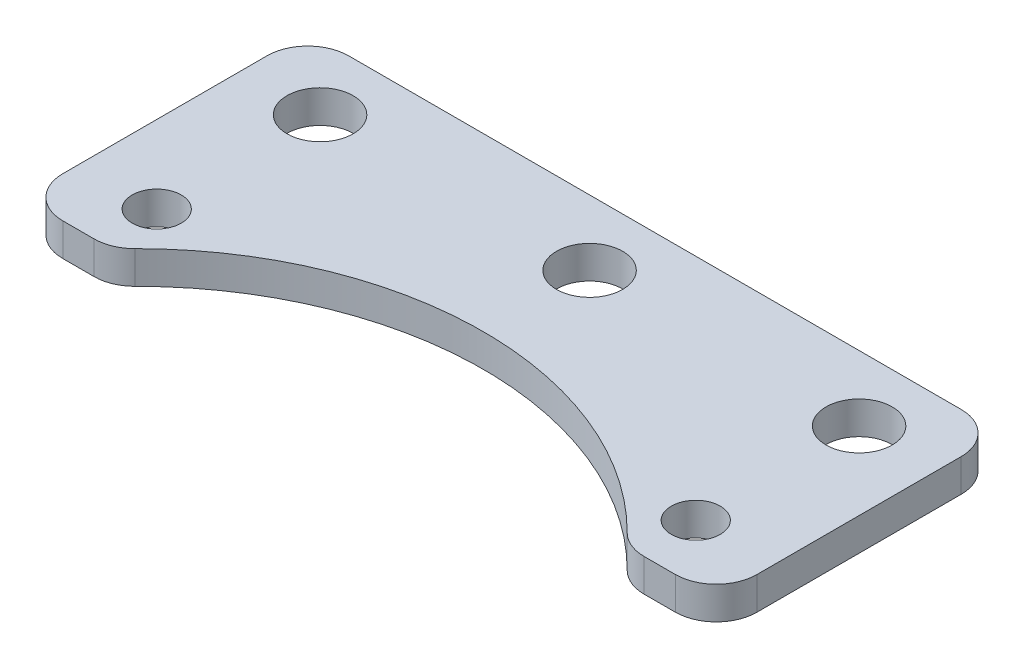
ISO-10303-21;
HEADER;
FILE_DESCRIPTION(('STEP AP214'),'2;1');
FILE_NAME('part.step','',(''),(''),'','','');
FILE_SCHEMA(('AUTOMOTIVE_DESIGN { 1 0 10303 214 1 1 1 1 }'));
ENDSEC;
DATA;
#1=APPLICATION_CONTEXT('core data for automotive mechanical design processes');
#2=APPLICATION_PROTOCOL_DEFINITION('international standard','automotive_design',2000,#1);
#3=PRODUCT_CONTEXT('',#1,'mechanical');
#4=PRODUCT('Part','Part','',(#3));
#5=PRODUCT_RELATED_PRODUCT_CATEGORY('part','',(#4));
#6=PRODUCT_DEFINITION_FORMATION('','',#4);
#7=PRODUCT_DEFINITION_CONTEXT('part definition',#1,'design');
#8=PRODUCT_DEFINITION('design','',#6,#7);
#9=PRODUCT_DEFINITION_SHAPE('','',#8);
#10=(LENGTH_UNIT() NAMED_UNIT(*) SI_UNIT(.MILLI.,.METRE.));
#11=(NAMED_UNIT(*) PLANE_ANGLE_UNIT() SI_UNIT($,.RADIAN.));
#12=(NAMED_UNIT(*) SI_UNIT($,.STERADIAN.) SOLID_ANGLE_UNIT());
#13=UNCERTAINTY_MEASURE_WITH_UNIT(LENGTH_MEASURE(1.E-05),#10,'distance_accuracy_value','');
#14=(GEOMETRIC_REPRESENTATION_CONTEXT(3) GLOBAL_UNCERTAINTY_ASSIGNED_CONTEXT((#13)) GLOBAL_UNIT_ASSIGNED_CONTEXT((#10,
#11,#12)) REPRESENTATION_CONTEXT('',''));
#15=CARTESIAN_POINT('',(0.,0.,0.));
#16=DIRECTION('',(0.,0.,1.));
#17=DIRECTION('',(1.,0.,0.));
#18=AXIS2_PLACEMENT_3D('',#15,#16,#17);
#19=CARTESIAN_POINT('',(0.,4.,46.));
#20=DIRECTION('',(0.,-1.,0.));
#21=DIRECTION('',(0.,0.,-1.));
#22=AXIS2_PLACEMENT_3D('',#19,#20,#21);
#23=CYLINDRICAL_SURFACE('',#22,42.5);
#24=CARTESIAN_POINT('',(0.,0.,46.));
#25=DIRECTION('',(0.,1.,0.));
#26=DIRECTION('',(0.,0.,1.));
#27=AXIS2_PLACEMENT_3D('',#24,#25,#26);
#28=CIRCLE('',#27,42.5);
#29=CARTESIAN_POINT('',(30.1301884303375,0.,16.0263157894737));
#30=VERTEX_POINT('',#29);
#31=CARTESIAN_POINT('',(-30.1301884303375,0.,16.0263157894737));
#32=VERTEX_POINT('',#31);
#33=EDGE_CURVE('E261',#30,#32,#28,.T.);
#34=ORIENTED_EDGE('',*,*,#33,.F.);
#35=DIRECTION('',(0.,-1.,0.));
#36=VECTOR('',#35,1.);
#37=CARTESIAN_POINT('',(30.1301884303375,4.,16.0263157894737));
#38=LINE('',#37,#36);
#39=CARTESIAN_POINT('',(30.1301884303375,4.,16.0263157894737));
#40=VERTEX_POINT('',#39);
#41=EDGE_CURVE('E220',#30,#40,#38,.F.);
#42=ORIENTED_EDGE('',*,*,#41,.T.);
#43=CARTESIAN_POINT('',(0.,4.,46.));
#44=DIRECTION('',(0.,1.,0.));
#45=DIRECTION('',(0.,0.,1.));
#46=AXIS2_PLACEMENT_3D('',#43,#44,#45);
#47=CIRCLE('',#46,42.5);
#48=CARTESIAN_POINT('',(-30.1301884303375,4.,16.0263157894737));
#49=VERTEX_POINT('',#48);
#50=EDGE_CURVE('E293',#40,#49,#47,.T.);
#51=ORIENTED_EDGE('',*,*,#50,.T.);
#52=DIRECTION('',(0.,-1.,0.));
#53=VECTOR('',#52,1.);
#54=CARTESIAN_POINT('',(-30.1301884303375,4.,16.0263157894737));
#55=LINE('',#54,#53);
#56=EDGE_CURVE('E216',#49,#32,#55,.T.);
#57=ORIENTED_EDGE('',*,*,#56,.T.);
#58=EDGE_LOOP('',(#34,#42,#51,#57));
#59=FACE_BOUND('',#58,.T.);
#60=ADVANCED_FACE('F41',(#59),#23,.F.);
#61=CARTESIAN_POINT('',(0.,4.,17.5));
#62=DIRECTION('',(0.,0.,-1.));
#63=DIRECTION('',(-1.,0.,0.));
#64=AXIS2_PLACEMENT_3D('',#61,#62,#63);
#65=PLANE('',#64);
#66=DIRECTION('',(1.,0.,0.));
#67=VECTOR('',#66,1.);
#68=CARTESIAN_POINT('',(0.,0.,17.5));
#69=LINE('',#68,#67);
#70=CARTESIAN_POINT('',(33.6749164809655,0.,17.5));
#71=VERTEX_POINT('',#70);
#72=CARTESIAN_POINT('',(37.5,0.,17.5));
#73=VERTEX_POINT('',#72);
#74=EDGE_CURVE('E265',#71,#73,#69,.T.);
#75=ORIENTED_EDGE('',*,*,#74,.T.);
#76=DIRECTION('',(0.,-1.,0.));
#77=VECTOR('',#76,1.);
#78=CARTESIAN_POINT('',(37.5,4.,17.5));
#79=LINE('',#78,#77);
#80=CARTESIAN_POINT('',(37.5,4.,17.5));
#81=VERTEX_POINT('',#80);
#82=EDGE_CURVE('E213',#73,#81,#79,.F.);
#83=ORIENTED_EDGE('',*,*,#82,.T.);
#84=DIRECTION('',(1.,0.,0.));
#85=VECTOR('',#84,1.);
#86=CARTESIAN_POINT('',(0.,4.,17.5));
#87=LINE('',#86,#85);
#88=CARTESIAN_POINT('',(33.6749164809655,4.,17.5));
#89=VERTEX_POINT('',#88);
#90=EDGE_CURVE('E242',#89,#81,#87,.T.);
#91=ORIENTED_EDGE('',*,*,#90,.F.);
#92=DIRECTION('',(0.,1.,0.));
#93=VECTOR('',#92,1.);
#94=CARTESIAN_POINT('',(33.6749164809655,0.,17.5));
#95=LINE('',#94,#93);
#96=EDGE_CURVE('E209',#89,#71,#95,.F.);
#97=ORIENTED_EDGE('',*,*,#96,.T.);
#98=EDGE_LOOP('',(#75,#83,#91,#97));
#99=FACE_BOUND('',#98,.T.);
#100=ADVANCED_FACE('F323',(#99),#65,.F.);
#101=CARTESIAN_POINT('',(42.5,4.,0.));
#102=DIRECTION('',(-1.,0.,0.));
#103=DIRECTION('',(0.,0.,1.));
#104=AXIS2_PLACEMENT_3D('',#101,#102,#103);
#105=PLANE('',#104);
#106=DIRECTION('',(0.,0.,-1.));
#107=VECTOR('',#106,1.);
#108=CARTESIAN_POINT('',(42.5,0.,0.));
#109=LINE('',#108,#107);
#110=CARTESIAN_POINT('',(42.5,0.,12.5));
#111=VERTEX_POINT('',#110);
#112=CARTESIAN_POINT('',(42.5,0.,-12.5));
#113=VERTEX_POINT('',#112);
#114=EDGE_CURVE('E155',#111,#113,#109,.T.);
#115=ORIENTED_EDGE('',*,*,#114,.T.);
#116=DIRECTION('',(0.,-1.,0.));
#117=VECTOR('',#116,1.);
#118=CARTESIAN_POINT('',(42.5,4.,-12.5));
#119=LINE('',#118,#117);
#120=CARTESIAN_POINT('',(42.5,4.,-12.5));
#121=VERTEX_POINT('',#120);
#122=EDGE_CURVE('E190',#113,#121,#119,.F.);
#123=ORIENTED_EDGE('',*,*,#122,.T.);
#124=DIRECTION('',(0.,0.,-1.));
#125=VECTOR('',#124,1.);
#126=CARTESIAN_POINT('',(42.5,4.,0.));
#127=LINE('',#126,#125);
#128=CARTESIAN_POINT('',(42.5,4.,12.5));
#129=VERTEX_POINT('',#128);
#130=EDGE_CURVE('E243',#129,#121,#127,.T.);
#131=ORIENTED_EDGE('',*,*,#130,.F.);
#132=DIRECTION('',(0.,-1.,0.));
#133=VECTOR('',#132,1.);
#134=CARTESIAN_POINT('',(42.5,4.,12.5));
#135=LINE('',#134,#133);
#136=EDGE_CURVE('E186',#129,#111,#135,.T.);
#137=ORIENTED_EDGE('',*,*,#136,.T.);
#138=EDGE_LOOP('',(#115,#123,#131,#137));
#139=FACE_BOUND('',#138,.T.);
#140=ADVANCED_FACE('F317',(#139),#105,.F.);
#141=CARTESIAN_POINT('',(0.,4.,-17.5));
#142=DIRECTION('',(0.,0.,-1.));
#143=DIRECTION('',(-1.,0.,0.));
#144=AXIS2_PLACEMENT_3D('',#141,#142,#143);
#145=PLANE('',#144);
#146=DIRECTION('',(1.,0.,0.));
#147=VECTOR('',#146,1.);
#148=CARTESIAN_POINT('',(0.,4.,-17.5));
#149=LINE('',#148,#147);
#150=CARTESIAN_POINT('',(-37.5,4.,-17.5));
#151=VERTEX_POINT('',#150);
#152=CARTESIAN_POINT('',(37.5,4.,-17.5));
#153=VERTEX_POINT('',#152);
#154=EDGE_CURVE('E236',#151,#153,#149,.T.);
#155=ORIENTED_EDGE('',*,*,#154,.T.);
#156=DIRECTION('',(0.,-1.,0.));
#157=VECTOR('',#156,1.);
#158=CARTESIAN_POINT('',(37.5,0.,-17.5));
#159=LINE('',#158,#157);
#160=CARTESIAN_POINT('',(37.5,0.,-17.5));
#161=VERTEX_POINT('',#160);
#162=EDGE_CURVE('E145',#153,#161,#159,.T.);
#163=ORIENTED_EDGE('',*,*,#162,.T.);
#164=DIRECTION('',(1.,0.,0.));
#165=VECTOR('',#164,1.);
#166=CARTESIAN_POINT('',(0.,0.,-17.5));
#167=LINE('',#166,#165);
#168=CARTESIAN_POINT('',(-37.5,0.,-17.5));
#169=VERTEX_POINT('',#168);
#170=EDGE_CURVE('E136',#169,#161,#167,.T.);
#171=ORIENTED_EDGE('',*,*,#170,.F.);
#172=DIRECTION('',(0.,-1.,0.));
#173=VECTOR('',#172,1.);
#174=CARTESIAN_POINT('',(-37.5,4.,-17.5));
#175=LINE('',#174,#173);
#176=EDGE_CURVE('E151',#169,#151,#175,.F.);
#177=ORIENTED_EDGE('',*,*,#176,.T.);
#178=EDGE_LOOP('',(#155,#163,#171,#177));
#179=FACE_BOUND('',#178,.T.);
#180=ADVANCED_FACE('F150',(#179),#145,.T.);
#181=CARTESIAN_POINT('',(-42.5,4.,0.));
#182=DIRECTION('',(-1.,0.,0.));
#183=DIRECTION('',(0.,0.,1.));
#184=AXIS2_PLACEMENT_3D('',#181,#182,#183);
#185=PLANE('',#184);
#186=DIRECTION('',(0.,0.,-1.));
#187=VECTOR('',#186,1.);
#188=CARTESIAN_POINT('',(-42.5,0.,0.));
#189=LINE('',#188,#187);
#190=CARTESIAN_POINT('',(-42.5,0.,12.5));
#191=VERTEX_POINT('',#190);
#192=CARTESIAN_POINT('',(-42.5,0.,-12.5));
#193=VERTEX_POINT('',#192);
#194=EDGE_CURVE('E138',#191,#193,#189,.T.);
#195=ORIENTED_EDGE('',*,*,#194,.F.);
#196=DIRECTION('',(0.,-1.,0.));
#197=VECTOR('',#196,1.);
#198=CARTESIAN_POINT('',(-42.5,4.,12.5));
#199=LINE('',#198,#197);
#200=CARTESIAN_POINT('',(-42.5,4.,12.5));
#201=VERTEX_POINT('',#200);
#202=EDGE_CURVE('E11',#191,#201,#199,.F.);
#203=ORIENTED_EDGE('',*,*,#202,.T.);
#204=DIRECTION('',(0.,0.,-1.));
#205=VECTOR('',#204,1.);
#206=CARTESIAN_POINT('',(-42.5,4.,0.));
#207=LINE('',#206,#205);
#208=CARTESIAN_POINT('',(-42.5,4.,-12.5));
#209=VERTEX_POINT('',#208);
#210=EDGE_CURVE('E233',#201,#209,#207,.T.);
#211=ORIENTED_EDGE('',*,*,#210,.T.);
#212=DIRECTION('',(0.,-1.,0.));
#213=VECTOR('',#212,1.);
#214=CARTESIAN_POINT('',(-42.5,4.,-12.5));
#215=LINE('',#214,#213);
#216=EDGE_CURVE('E50',#209,#193,#215,.T.);
#217=ORIENTED_EDGE('',*,*,#216,.T.);
#218=EDGE_LOOP('',(#195,#203,#211,#217));
#219=FACE_BOUND('',#218,.T.);
#220=ADVANCED_FACE('F231',(#219),#185,.T.);
#221=CARTESIAN_POINT('',(33.,4.,10.5));
#222=DIRECTION('',(0.,-1.,0.));
#223=DIRECTION('',(0.,0.,-1.));
#224=AXIS2_PLACEMENT_3D('',#221,#222,#223);
#225=CYLINDRICAL_SURFACE('',#224,3.);
#226=CARTESIAN_POINT('',(33.,4.,10.5));
#227=DIRECTION('',(0.,1.,0.));
#228=DIRECTION('',(0.,0.,1.));
#229=AXIS2_PLACEMENT_3D('',#226,#227,#228);
#230=CIRCLE('',#229,3.);
#231=CARTESIAN_POINT('',(33.,4.,13.5));
#232=VERTEX_POINT('',#231);
#233=EDGE_CURVE('E166',#232,#232,#230,.T.);
#234=ORIENTED_EDGE('',*,*,#233,.T.);
#235=EDGE_LOOP('',(#234));
#236=FACE_BOUND('',#235,.T.);
#237=CARTESIAN_POINT('',(33.,0.,10.5));
#238=DIRECTION('',(0.,1.,0.));
#239=DIRECTION('',(0.,0.,1.));
#240=AXIS2_PLACEMENT_3D('',#237,#238,#239);
#241=CIRCLE('',#240,3.);
#242=CARTESIAN_POINT('',(33.,0.,13.5));
#243=VERTEX_POINT('',#242);
#244=EDGE_CURVE('E286',#243,#243,#241,.T.);
#245=ORIENTED_EDGE('',*,*,#244,.F.);
#246=EDGE_LOOP('',(#245));
#247=FACE_BOUND('',#246,.T.);
#248=ADVANCED_FACE('F448',(#236,#247),#225,.F.);
#249=CARTESIAN_POINT('',(-33.,4.,-9.5));
#250=DIRECTION('',(0.,-1.,0.));
#251=DIRECTION('',(0.,0.,-1.));
#252=AXIS2_PLACEMENT_3D('',#249,#250,#251);
#253=CYLINDRICAL_SURFACE('',#252,4.05);
#254=CARTESIAN_POINT('',(-33.,4.,-9.5));
#255=DIRECTION('',(0.,1.,0.));
#256=DIRECTION('',(0.,0.,1.));
#257=AXIS2_PLACEMENT_3D('',#254,#255,#256);
#258=CIRCLE('',#257,4.05);
#259=CARTESIAN_POINT('',(-33.,4.,-5.45));
#260=VERTEX_POINT('',#259);
#261=EDGE_CURVE('E254',#260,#260,#258,.T.);
#262=ORIENTED_EDGE('',*,*,#261,.T.);
#263=EDGE_LOOP('',(#262));
#264=FACE_BOUND('',#263,.T.);
#265=CARTESIAN_POINT('',(-33.,0.,-9.5));
#266=DIRECTION('',(0.,1.,0.));
#267=DIRECTION('',(0.,0.,1.));
#268=AXIS2_PLACEMENT_3D('',#265,#266,#267);
#269=CIRCLE('',#268,4.05);
#270=CARTESIAN_POINT('',(-33.,0.,-5.45));
#271=VERTEX_POINT('',#270);
#272=EDGE_CURVE('E283',#271,#271,#269,.T.);
#273=ORIENTED_EDGE('',*,*,#272,.F.);
#274=EDGE_LOOP('',(#273));
#275=FACE_BOUND('',#274,.T.);
#276=ADVANCED_FACE('F439',(#264,#275),#253,.F.);
#277=CARTESIAN_POINT('',(33.,4.,-9.5));
#278=DIRECTION('',(0.,-1.,0.));
#279=DIRECTION('',(0.,0.,-1.));
#280=AXIS2_PLACEMENT_3D('',#277,#278,#279);
#281=CYLINDRICAL_SURFACE('',#280,4.05);
#282=CARTESIAN_POINT('',(33.,4.,-9.5));
#283=DIRECTION('',(0.,1.,0.));
#284=DIRECTION('',(0.,0.,1.));
#285=AXIS2_PLACEMENT_3D('',#282,#283,#284);
#286=CIRCLE('',#285,4.05);
#287=CARTESIAN_POINT('',(33.,4.,-5.45));
#288=VERTEX_POINT('',#287);
#289=EDGE_CURVE('E250',#288,#288,#286,.T.);
#290=ORIENTED_EDGE('',*,*,#289,.T.);
#291=EDGE_LOOP('',(#290));
#292=FACE_BOUND('',#291,.T.);
#293=CARTESIAN_POINT('',(33.,0.,-9.5));
#294=DIRECTION('',(0.,1.,0.));
#295=DIRECTION('',(0.,0.,1.));
#296=AXIS2_PLACEMENT_3D('',#293,#294,#295);
#297=CIRCLE('',#296,4.05);
#298=CARTESIAN_POINT('',(33.,0.,-5.45));
#299=VERTEX_POINT('',#298);
#300=EDGE_CURVE('E279',#299,#299,#297,.T.);
#301=ORIENTED_EDGE('',*,*,#300,.F.);
#302=EDGE_LOOP('',(#301));
#303=FACE_BOUND('',#302,.T.);
#304=ADVANCED_FACE('F430',(#292,#303),#281,.F.);
#305=CARTESIAN_POINT('',(0.,4.,-9.5));
#306=DIRECTION('',(0.,-1.,0.));
#307=DIRECTION('',(0.,0.,-1.));
#308=AXIS2_PLACEMENT_3D('',#305,#306,#307);
#309=CYLINDRICAL_SURFACE('',#308,4.05);
#310=CARTESIAN_POINT('',(0.,4.,-9.5));
#311=DIRECTION('',(0.,1.,0.));
#312=DIRECTION('',(0.,0.,1.));
#313=AXIS2_PLACEMENT_3D('',#310,#311,#312);
#314=CIRCLE('',#313,4.05);
#315=CARTESIAN_POINT('',(0.,4.,-5.45));
#316=VERTEX_POINT('',#315);
#317=EDGE_CURVE('E240',#316,#316,#314,.T.);
#318=ORIENTED_EDGE('',*,*,#317,.T.);
#319=EDGE_LOOP('',(#318));
#320=FACE_BOUND('',#319,.T.);
#321=CARTESIAN_POINT('',(0.,0.,-9.5));
#322=DIRECTION('',(0.,1.,0.));
#323=DIRECTION('',(0.,0.,1.));
#324=AXIS2_PLACEMENT_3D('',#321,#322,#323);
#325=CIRCLE('',#324,4.05);
#326=CARTESIAN_POINT('',(0.,0.,-5.45));
#327=VERTEX_POINT('',#326);
#328=EDGE_CURVE('E275',#327,#327,#325,.T.);
#329=ORIENTED_EDGE('',*,*,#328,.F.);
#330=EDGE_LOOP('',(#329));
#331=FACE_BOUND('',#330,.T.);
#332=ADVANCED_FACE('F423',(#320,#331),#309,.F.);
#333=CARTESIAN_POINT('',(-37.5,0.,17.5));
#334=VERTEX_POINT('',#333);
#335=CARTESIAN_POINT('',(-33.6749164809655,0.,17.5));
#336=VERTEX_POINT('',#335);
#337=EDGE_CURVE('E269',#334,#336,#69,.T.);
#338=ORIENTED_EDGE('',*,*,#337,.T.);
#339=DIRECTION('',(0.,1.,0.));
#340=VECTOR('',#339,1.);
#341=CARTESIAN_POINT('',(-33.6749164809655,4.,17.5));
#342=LINE('',#341,#340);
#343=CARTESIAN_POINT('',(-33.6749164809655,4.,17.5));
#344=VERTEX_POINT('',#343);
#345=EDGE_CURVE('E57',#336,#344,#342,.T.);
#346=ORIENTED_EDGE('',*,*,#345,.T.);
#347=CARTESIAN_POINT('',(-37.5,4.,17.5));
#348=VERTEX_POINT('',#347);
#349=EDGE_CURVE('E235',#348,#344,#87,.T.);
#350=ORIENTED_EDGE('',*,*,#349,.F.);
#351=DIRECTION('',(0.,-1.,0.));
#352=VECTOR('',#351,1.);
#353=CARTESIAN_POINT('',(-37.5,0.,17.5));
#354=LINE('',#353,#352);
#355=EDGE_CURVE('E223',#348,#334,#354,.T.);
#356=ORIENTED_EDGE('',*,*,#355,.T.);
#357=EDGE_LOOP('',(#338,#346,#350,#356));
#358=FACE_BOUND('',#357,.T.);
#359=ADVANCED_FACE('F335',(#358),#65,.F.);
#360=CARTESIAN_POINT('',(-33.,4.,10.5));
#361=DIRECTION('',(0.,-1.,0.));
#362=DIRECTION('',(0.,0.,-1.));
#363=AXIS2_PLACEMENT_3D('',#360,#361,#362);
#364=CYLINDRICAL_SURFACE('',#363,3.);
#365=CARTESIAN_POINT('',(-33.,4.,10.5));
#366=DIRECTION('',(0.,1.,0.));
#367=DIRECTION('',(0.,0.,1.));
#368=AXIS2_PLACEMENT_3D('',#365,#366,#367);
#369=CIRCLE('',#368,3.);
#370=CARTESIAN_POINT('',(-33.,4.,13.5));
#371=VERTEX_POINT('',#370);
#372=EDGE_CURVE('E160',#371,#371,#369,.T.);
#373=ORIENTED_EDGE('',*,*,#372,.T.);
#374=EDGE_LOOP('',(#373));
#375=FACE_BOUND('',#374,.T.);
#376=CARTESIAN_POINT('',(-33.,0.,10.5));
#377=DIRECTION('',(0.,1.,0.));
#378=DIRECTION('',(0.,0.,1.));
#379=AXIS2_PLACEMENT_3D('',#376,#377,#378);
#380=CIRCLE('',#379,3.);
#381=CARTESIAN_POINT('',(-33.,0.,13.5));
#382=VERTEX_POINT('',#381);
#383=EDGE_CURVE('E169',#382,#382,#380,.T.);
#384=ORIENTED_EDGE('',*,*,#383,.F.);
#385=EDGE_LOOP('',(#384));
#386=FACE_BOUND('',#385,.T.);
#387=ADVANCED_FACE('F406',(#375,#386),#364,.F.);
#388=CARTESIAN_POINT('',(0.,4.,0.));
#389=DIRECTION('',(0.,1.,0.));
#390=DIRECTION('',(0.,0.,1.));
#391=AXIS2_PLACEMENT_3D('',#388,#389,#390);
#392=PLANE('',#391);
#393=ORIENTED_EDGE('',*,*,#130,.T.);
#394=CARTESIAN_POINT('',(37.5,4.,-12.5));
#395=DIRECTION('',(0.,1.,0.));
#396=DIRECTION('',(0.,0.,1.));
#397=AXIS2_PLACEMENT_3D('',#394,#395,#396);
#398=CIRCLE('',#397,5.);
#399=EDGE_CURVE('E206',#121,#153,#398,.T.);
#400=ORIENTED_EDGE('',*,*,#399,.T.);
#401=ORIENTED_EDGE('',*,*,#154,.F.);
#402=CARTESIAN_POINT('',(-37.5,4.,-12.5));
#403=DIRECTION('',(0.,1.,0.));
#404=DIRECTION('',(0.,0.,1.));
#405=AXIS2_PLACEMENT_3D('',#402,#403,#404);
#406=CIRCLE('',#405,5.);
#407=EDGE_CURVE('E158',#151,#209,#406,.T.);
#408=ORIENTED_EDGE('',*,*,#407,.T.);
#409=ORIENTED_EDGE('',*,*,#210,.F.);
#410=CARTESIAN_POINT('',(-37.5,4.,12.5));
#411=DIRECTION('',(0.,1.,0.));
#412=DIRECTION('',(0.,0.,1.));
#413=AXIS2_PLACEMENT_3D('',#410,#411,#412);
#414=CIRCLE('',#413,5.);
#415=EDGE_CURVE('E64',#201,#348,#414,.T.);
#416=ORIENTED_EDGE('',*,*,#415,.T.);
#417=ORIENTED_EDGE('',*,*,#349,.T.);
#418=CARTESIAN_POINT('',(-33.6749164809655,4.,12.5));
#419=DIRECTION('',(0.,1.,0.));
#420=DIRECTION('',(0.,0.,1.));
#421=AXIS2_PLACEMENT_3D('',#418,#419,#420);
#422=CIRCLE('',#421,5.);
#423=EDGE_CURVE('E197',#344,#49,#422,.T.);
#424=ORIENTED_EDGE('',*,*,#423,.T.);
#425=ORIENTED_EDGE('',*,*,#50,.F.);
#426=CARTESIAN_POINT('',(33.6749164809655,4.,12.5));
#427=DIRECTION('',(0.,1.,0.));
#428=DIRECTION('',(0.,0.,1.));
#429=AXIS2_PLACEMENT_3D('',#426,#427,#428);
#430=CIRCLE('',#429,5.);
#431=EDGE_CURVE('E200',#40,#89,#430,.T.);
#432=ORIENTED_EDGE('',*,*,#431,.T.);
#433=ORIENTED_EDGE('',*,*,#90,.T.);
#434=CARTESIAN_POINT('',(37.5,4.,12.5));
#435=DIRECTION('',(0.,1.,0.));
#436=DIRECTION('',(0.,0.,1.));
#437=AXIS2_PLACEMENT_3D('',#434,#435,#436);
#438=CIRCLE('',#437,5.);
#439=EDGE_CURVE('E203',#81,#129,#438,.T.);
#440=ORIENTED_EDGE('',*,*,#439,.T.);
#441=EDGE_LOOP('',(#393,#400,#401,#408,#409,#416,#417,#424,#425,#432,#433,#440));
#442=FACE_BOUND('',#441,.T.);
#443=ORIENTED_EDGE('',*,*,#317,.F.);
#444=EDGE_LOOP('',(#443));
#445=FACE_BOUND('',#444,.T.);
#446=ORIENTED_EDGE('',*,*,#289,.F.);
#447=EDGE_LOOP('',(#446));
#448=FACE_BOUND('',#447,.T.);
#449=ORIENTED_EDGE('',*,*,#261,.F.);
#450=EDGE_LOOP('',(#449));
#451=FACE_BOUND('',#450,.T.);
#452=ORIENTED_EDGE('',*,*,#233,.F.);
#453=EDGE_LOOP('',(#452));
#454=FACE_BOUND('',#453,.T.);
#455=ORIENTED_EDGE('',*,*,#372,.F.);
#456=EDGE_LOOP('',(#455));
#457=FACE_BOUND('',#456,.T.);
#458=ADVANCED_FACE('F308',(#442,#445,#448,#451,#454,#457),#392,.T.);
#459=CARTESIAN_POINT('',(0.,0.,0.));
#460=DIRECTION('',(0.,1.,0.));
#461=DIRECTION('',(0.,0.,1.));
#462=AXIS2_PLACEMENT_3D('',#459,#460,#461);
#463=PLANE('',#462);
#464=ORIENTED_EDGE('',*,*,#170,.T.);
#465=CARTESIAN_POINT('',(37.5,0.,-12.5));
#466=DIRECTION('',(0.,1.,0.));
#467=DIRECTION('',(0.,0.,1.));
#468=AXIS2_PLACEMENT_3D('',#465,#466,#467);
#469=CIRCLE('',#468,5.);
#470=EDGE_CURVE('E183',#161,#113,#469,.F.);
#471=ORIENTED_EDGE('',*,*,#470,.T.);
#472=ORIENTED_EDGE('',*,*,#114,.F.);
#473=CARTESIAN_POINT('',(37.5,0.,12.5));
#474=DIRECTION('',(0.,1.,0.));
#475=DIRECTION('',(0.,0.,1.));
#476=AXIS2_PLACEMENT_3D('',#473,#474,#475);
#477=CIRCLE('',#476,5.);
#478=EDGE_CURVE('E180',#111,#73,#477,.F.);
#479=ORIENTED_EDGE('',*,*,#478,.T.);
#480=ORIENTED_EDGE('',*,*,#74,.F.);
#481=CARTESIAN_POINT('',(33.6749164809655,0.,12.5));
#482=DIRECTION('',(0.,1.,0.));
#483=DIRECTION('',(0.,0.,1.));
#484=AXIS2_PLACEMENT_3D('',#481,#482,#483);
#485=CIRCLE('',#484,5.);
#486=EDGE_CURVE('E177',#71,#30,#485,.F.);
#487=ORIENTED_EDGE('',*,*,#486,.T.);
#488=ORIENTED_EDGE('',*,*,#33,.T.);
#489=CARTESIAN_POINT('',(-33.6749164809655,0.,12.5));
#490=DIRECTION('',(0.,1.,0.));
#491=DIRECTION('',(0.,0.,1.));
#492=AXIS2_PLACEMENT_3D('',#489,#490,#491);
#493=CIRCLE('',#492,5.);
#494=EDGE_CURVE('E174',#32,#336,#493,.F.);
#495=ORIENTED_EDGE('',*,*,#494,.T.);
#496=ORIENTED_EDGE('',*,*,#337,.F.);
#497=CARTESIAN_POINT('',(-37.5,0.,12.5));
#498=DIRECTION('',(0.,1.,0.));
#499=DIRECTION('',(0.,0.,1.));
#500=AXIS2_PLACEMENT_3D('',#497,#498,#499);
#501=CIRCLE('',#500,5.);
#502=EDGE_CURVE('E144',#334,#191,#501,.F.);
#503=ORIENTED_EDGE('',*,*,#502,.T.);
#504=ORIENTED_EDGE('',*,*,#194,.T.);
#505=CARTESIAN_POINT('',(-37.5,0.,-12.5));
#506=DIRECTION('',(0.,1.,0.));
#507=DIRECTION('',(0.,0.,1.));
#508=AXIS2_PLACEMENT_3D('',#505,#506,#507);
#509=CIRCLE('',#508,5.);
#510=EDGE_CURVE('E132',#193,#169,#509,.F.);
#511=ORIENTED_EDGE('',*,*,#510,.T.);
#512=EDGE_LOOP('',(#464,#471,#472,#479,#480,#487,#488,#495,#496,#503,#504,#511));
#513=FACE_BOUND('',#512,.T.);
#514=ORIENTED_EDGE('',*,*,#328,.T.);
#515=EDGE_LOOP('',(#514));
#516=FACE_BOUND('',#515,.T.);
#517=ORIENTED_EDGE('',*,*,#300,.T.);
#518=EDGE_LOOP('',(#517));
#519=FACE_BOUND('',#518,.T.);
#520=ORIENTED_EDGE('',*,*,#272,.T.);
#521=EDGE_LOOP('',(#520));
#522=FACE_BOUND('',#521,.T.);
#523=ORIENTED_EDGE('',*,*,#244,.T.);
#524=EDGE_LOOP('',(#523));
#525=FACE_BOUND('',#524,.T.);
#526=ORIENTED_EDGE('',*,*,#383,.T.);
#527=EDGE_LOOP('',(#526));
#528=FACE_BOUND('',#527,.T.);
#529=ADVANCED_FACE('F134',(#513,#516,#519,#522,#525,#528),#463,.F.);
#530=CARTESIAN_POINT('',(37.5,4.,-12.5));
#531=DIRECTION('',(0.,1.,0.));
#532=DIRECTION('',(0.,0.,1.));
#533=AXIS2_PLACEMENT_3D('',#530,#531,#532);
#534=CYLINDRICAL_SURFACE('',#533,5.);
#535=ORIENTED_EDGE('',*,*,#399,.F.);
#536=ORIENTED_EDGE('',*,*,#122,.F.);
#537=ORIENTED_EDGE('',*,*,#470,.F.);
#538=ORIENTED_EDGE('',*,*,#162,.F.);
#539=EDGE_LOOP('',(#535,#536,#537,#538));
#540=FACE_BOUND('',#539,.T.);
#541=ADVANCED_FACE('F315',(#540),#534,.T.);
#542=CARTESIAN_POINT('',(37.5,4.,12.5));
#543=DIRECTION('',(0.,-1.,0.));
#544=DIRECTION('',(0.,0.,-1.));
#545=AXIS2_PLACEMENT_3D('',#542,#543,#544);
#546=CYLINDRICAL_SURFACE('',#545,5.);
#547=ORIENTED_EDGE('',*,*,#439,.F.);
#548=ORIENTED_EDGE('',*,*,#82,.F.);
#549=ORIENTED_EDGE('',*,*,#478,.F.);
#550=ORIENTED_EDGE('',*,*,#136,.F.);
#551=EDGE_LOOP('',(#547,#548,#549,#550));
#552=FACE_BOUND('',#551,.T.);
#553=ADVANCED_FACE('F319',(#552),#546,.T.);
#554=CARTESIAN_POINT('',(33.6749164809655,4.,12.5));
#555=DIRECTION('',(0.,-1.,0.));
#556=DIRECTION('',(0.,0.,-1.));
#557=AXIS2_PLACEMENT_3D('',#554,#555,#556);
#558=CYLINDRICAL_SURFACE('',#557,5.);
#559=ORIENTED_EDGE('',*,*,#431,.F.);
#560=ORIENTED_EDGE('',*,*,#41,.F.);
#561=ORIENTED_EDGE('',*,*,#486,.F.);
#562=ORIENTED_EDGE('',*,*,#96,.F.);
#563=EDGE_LOOP('',(#559,#560,#561,#562));
#564=FACE_BOUND('',#563,.T.);
#565=ADVANCED_FACE('F328',(#564),#558,.T.);
#566=CARTESIAN_POINT('',(-33.6749164809655,4.,12.5));
#567=DIRECTION('',(0.,-1.,0.));
#568=DIRECTION('',(0.,0.,-1.));
#569=AXIS2_PLACEMENT_3D('',#566,#567,#568);
#570=CYLINDRICAL_SURFACE('',#569,5.);
#571=ORIENTED_EDGE('',*,*,#423,.F.);
#572=ORIENTED_EDGE('',*,*,#345,.F.);
#573=ORIENTED_EDGE('',*,*,#494,.F.);
#574=ORIENTED_EDGE('',*,*,#56,.F.);
#575=EDGE_LOOP('',(#571,#572,#573,#574));
#576=FACE_BOUND('',#575,.T.);
#577=ADVANCED_FACE('F333',(#576),#570,.T.);
#578=CARTESIAN_POINT('',(-37.5,4.,12.5));
#579=DIRECTION('',(0.,1.,0.));
#580=DIRECTION('',(0.,0.,1.));
#581=AXIS2_PLACEMENT_3D('',#578,#579,#580);
#582=CYLINDRICAL_SURFACE('',#581,5.);
#583=ORIENTED_EDGE('',*,*,#415,.F.);
#584=ORIENTED_EDGE('',*,*,#202,.F.);
#585=ORIENTED_EDGE('',*,*,#502,.F.);
#586=ORIENTED_EDGE('',*,*,#355,.F.);
#587=EDGE_LOOP('',(#583,#584,#585,#586));
#588=FACE_BOUND('',#587,.T.);
#589=ADVANCED_FACE('F339',(#588),#582,.T.);
#590=CARTESIAN_POINT('',(-37.5,4.,-12.5));
#591=DIRECTION('',(0.,-1.,0.));
#592=DIRECTION('',(0.,0.,-1.));
#593=AXIS2_PLACEMENT_3D('',#590,#591,#592);
#594=CYLINDRICAL_SURFACE('',#593,5.);
#595=ORIENTED_EDGE('',*,*,#407,.F.);
#596=ORIENTED_EDGE('',*,*,#176,.F.);
#597=ORIENTED_EDGE('',*,*,#510,.F.);
#598=ORIENTED_EDGE('',*,*,#216,.F.);
#599=EDGE_LOOP('',(#595,#596,#597,#598));
#600=FACE_BOUND('',#599,.T.);
#601=ADVANCED_FACE('F43',(#600),#594,.T.);
#602=CLOSED_SHELL('',(#60,#100,#140,#180,#220,#248,#276,#304,#332,#359,#387,#458,#529,#541,#553,
#565,#577,#589,#601));
#603=MANIFOLD_SOLID_BREP('B2',#602);
#604=ADVANCED_BREP_SHAPE_REPRESENTATION('',(#18,#603),#14);
#605=SHAPE_DEFINITION_REPRESENTATION(#9,#604);
ENDSEC;
END-ISO-10303-21;
